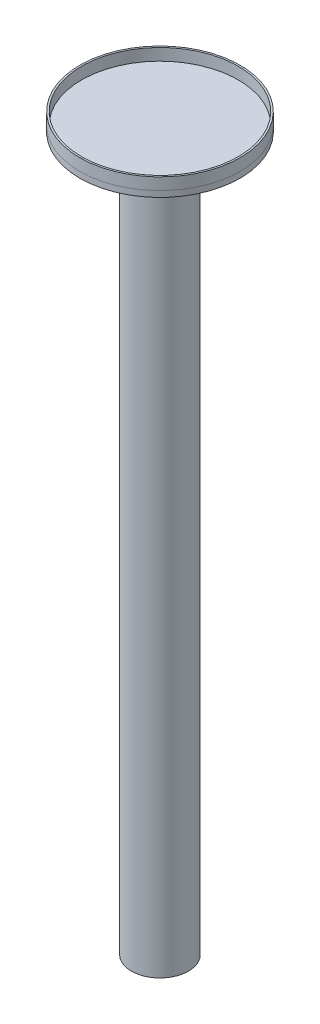
ISO-10303-21;
HEADER;
FILE_DESCRIPTION(('STEP AP214'),'2;1');
FILE_NAME('part.step','',(''),(''),'','','');
FILE_SCHEMA(('AUTOMOTIVE_DESIGN { 1 0 10303 214 1 1 1 1 }'));
ENDSEC;
DATA;
#1=APPLICATION_CONTEXT('core data for automotive mechanical design processes');
#2=APPLICATION_PROTOCOL_DEFINITION('international standard','automotive_design',2000,#1);
#3=PRODUCT_CONTEXT('',#1,'mechanical');
#4=PRODUCT('Part','Part','',(#3));
#5=PRODUCT_RELATED_PRODUCT_CATEGORY('part','',(#4));
#6=PRODUCT_DEFINITION_FORMATION('','',#4);
#7=PRODUCT_DEFINITION_CONTEXT('part definition',#1,'design');
#8=PRODUCT_DEFINITION('design','',#6,#7);
#9=PRODUCT_DEFINITION_SHAPE('','',#8);
#10=(LENGTH_UNIT() NAMED_UNIT(*) SI_UNIT(.MILLI.,.METRE.));
#11=(NAMED_UNIT(*) PLANE_ANGLE_UNIT() SI_UNIT($,.RADIAN.));
#12=(NAMED_UNIT(*) SI_UNIT($,.STERADIAN.) SOLID_ANGLE_UNIT());
#13=UNCERTAINTY_MEASURE_WITH_UNIT(LENGTH_MEASURE(1.E-05),#10,'distance_accuracy_value','');
#14=(GEOMETRIC_REPRESENTATION_CONTEXT(3) GLOBAL_UNCERTAINTY_ASSIGNED_CONTEXT((#13)) GLOBAL_UNIT_ASSIGNED_CONTEXT((#10,
#11,#12)) REPRESENTATION_CONTEXT('',''));
#15=CARTESIAN_POINT('',(0.,0.,0.));
#16=DIRECTION('',(0.,0.,1.));
#17=DIRECTION('',(1.,0.,0.));
#18=AXIS2_PLACEMENT_3D('',#15,#16,#17);
#19=CARTESIAN_POINT('',(0.,615.,0.));
#20=DIRECTION('',(0.,1.,0.));
#21=DIRECTION('',(0.,0.,1.));
#22=AXIS2_PLACEMENT_3D('',#19,#20,#21);
#23=PLANE('',#22);
#24=CARTESIAN_POINT('',(0.,615.,0.));
#25=DIRECTION('',(0.,1.,0.));
#26=DIRECTION('',(0.,0.,1.));
#27=AXIS2_PLACEMENT_3D('',#24,#25,#26);
#28=CIRCLE('',#27,67.5);
#29=CARTESIAN_POINT('',(0.,615.,67.5));
#30=VERTEX_POINT('',#29);
#31=EDGE_CURVE('E11',#30,#30,#28,.T.);
#32=ORIENTED_EDGE('',*,*,#31,.T.);
#33=EDGE_LOOP('',(#32));
#34=FACE_BOUND('',#33,.T.);
#35=CARTESIAN_POINT('',(0.,615.,0.));
#36=DIRECTION('',(0.,1.,0.));
#37=DIRECTION('',(0.,0.,1.));
#38=AXIS2_PLACEMENT_3D('',#35,#36,#37);
#39=CIRCLE('',#38,66.);
#40=CARTESIAN_POINT('',(0.,615.,66.));
#41=VERTEX_POINT('',#40);
#42=EDGE_CURVE('E50',#41,#41,#39,.T.);
#43=ORIENTED_EDGE('',*,*,#42,.F.);
#44=EDGE_LOOP('',(#43));
#45=FACE_BOUND('',#44,.T.);
#46=ADVANCED_FACE('F39',(#34,#45),#23,.T.);
#47=CARTESIAN_POINT('',(0.,605.,0.));
#48=DIRECTION('',(0.,1.,0.));
#49=DIRECTION('',(0.,0.,1.));
#50=AXIS2_PLACEMENT_3D('',#47,#48,#49);
#51=PLANE('',#50);
#52=CARTESIAN_POINT('',(0.,605.,0.));
#53=DIRECTION('',(0.,1.,0.));
#54=DIRECTION('',(0.,0.,1.));
#55=AXIS2_PLACEMENT_3D('',#52,#53,#54);
#56=CIRCLE('',#55,67.5);
#57=CARTESIAN_POINT('',(0.,605.,67.5));
#58=VERTEX_POINT('',#57);
#59=EDGE_CURVE('E43',#58,#58,#56,.T.);
#60=ORIENTED_EDGE('',*,*,#59,.F.);
#61=EDGE_LOOP('',(#60));
#62=FACE_BOUND('',#61,.T.);
#63=CARTESIAN_POINT('',(0.,605.,0.));
#64=DIRECTION('',(0.,1.,0.));
#65=DIRECTION('',(0.,0.,1.));
#66=AXIS2_PLACEMENT_3D('',#63,#64,#65);
#67=CIRCLE('',#66,66.);
#68=CARTESIAN_POINT('',(0.,605.,66.));
#69=VERTEX_POINT('',#68);
#70=EDGE_CURVE('E52',#69,#69,#67,.T.);
#71=ORIENTED_EDGE('',*,*,#70,.T.);
#72=EDGE_LOOP('',(#71));
#73=FACE_BOUND('',#72,.T.);
#74=ADVANCED_FACE('F62',(#62,#73),#51,.F.);
#75=CARTESIAN_POINT('',(0.,615.,0.));
#76=DIRECTION('',(0.,-1.,0.));
#77=DIRECTION('',(0.,0.,-1.));
#78=AXIS2_PLACEMENT_3D('',#75,#76,#77);
#79=CYLINDRICAL_SURFACE('',#78,67.5);
#80=ORIENTED_EDGE('',*,*,#31,.F.);
#81=EDGE_LOOP('',(#80));
#82=FACE_BOUND('',#81,.T.);
#83=ORIENTED_EDGE('',*,*,#59,.T.);
#84=EDGE_LOOP('',(#83));
#85=FACE_BOUND('',#84,.T.);
#86=ADVANCED_FACE('F41',(#82,#85),#79,.T.);
#87=CARTESIAN_POINT('',(0.,615.,0.));
#88=DIRECTION('',(0.,-1.,0.));
#89=DIRECTION('',(0.,0.,-1.));
#90=AXIS2_PLACEMENT_3D('',#87,#88,#89);
#91=CYLINDRICAL_SURFACE('',#90,66.);
#92=ORIENTED_EDGE('',*,*,#42,.T.);
#93=EDGE_LOOP('',(#92));
#94=FACE_BOUND('',#93,.T.);
#95=ORIENTED_EDGE('',*,*,#70,.F.);
#96=EDGE_LOOP('',(#95));
#97=FACE_BOUND('',#96,.T.);
#98=ADVANCED_FACE('F58',(#94,#97),#91,.F.);
#99=CLOSED_SHELL('',(#46,#74,#86,#98));
#100=MANIFOLD_SOLID_BREP('B2',#99);
#101=CARTESIAN_POINT('',(0.,600.,0.));
#102=DIRECTION('',(0.,-1.,0.));
#103=DIRECTION('',(0.,0.,-1.));
#104=AXIS2_PLACEMENT_3D('',#101,#102,#103);
#105=CYLINDRICAL_SURFACE('',#104,24.);
#106=CARTESIAN_POINT('',(0.,600.,0.));
#107=DIRECTION('',(0.,1.,0.));
#108=DIRECTION('',(0.,0.,1.));
#109=AXIS2_PLACEMENT_3D('',#106,#107,#108);
#110=CIRCLE('',#109,24.);
#111=CARTESIAN_POINT('',(0.,600.,24.));
#112=VERTEX_POINT('',#111);
#113=EDGE_CURVE('E38',#112,#112,#110,.T.);
#114=ORIENTED_EDGE('',*,*,#113,.F.);
#115=EDGE_LOOP('',(#114));
#116=FACE_BOUND('',#115,.T.);
#117=CARTESIAN_POINT('',(0.,0.,0.));
#118=DIRECTION('',(0.,1.,0.));
#119=DIRECTION('',(0.,0.,1.));
#120=AXIS2_PLACEMENT_3D('',#117,#118,#119);
#121=CIRCLE('',#120,24.);
#122=CARTESIAN_POINT('',(0.,0.,24.));
#123=VERTEX_POINT('',#122);
#124=EDGE_CURVE('E104',#123,#123,#121,.T.);
#125=ORIENTED_EDGE('',*,*,#124,.T.);
#126=EDGE_LOOP('',(#125));
#127=FACE_BOUND('',#126,.T.);
#128=ADVANCED_FACE('F101',(#116,#127),#105,.T.);
#129=CARTESIAN_POINT('',(0.,0.,0.));
#130=DIRECTION('',(0.,1.,0.));
#131=DIRECTION('',(0.,0.,1.));
#132=AXIS2_PLACEMENT_3D('',#129,#130,#131);
#133=PLANE('',#132);
#134=ORIENTED_EDGE('',*,*,#124,.F.);
#135=EDGE_LOOP('',(#134));
#136=FACE_BOUND('',#135,.T.);
#137=ADVANCED_FACE('F124',(#136),#133,.F.);
#138=CARTESIAN_POINT('',(0.,605.,0.));
#139=DIRECTION('',(0.,-1.,0.));
#140=DIRECTION('',(0.,0.,-1.));
#141=AXIS2_PLACEMENT_3D('',#138,#139,#140);
#142=CYLINDRICAL_SURFACE('',#141,67.5);
#143=CARTESIAN_POINT('',(0.,605.,0.));
#144=DIRECTION('',(0.,1.,0.));
#145=DIRECTION('',(0.,0.,1.));
#146=AXIS2_PLACEMENT_3D('',#143,#144,#145);
#147=CIRCLE('',#146,67.5);
#148=CARTESIAN_POINT('',(0.,605.,67.5));
#149=VERTEX_POINT('',#148);
#150=EDGE_CURVE('E111',#149,#149,#147,.T.);
#151=ORIENTED_EDGE('',*,*,#150,.F.);
#152=EDGE_LOOP('',(#151));
#153=FACE_BOUND('',#152,.T.);
#154=CARTESIAN_POINT('',(0.,600.,0.));
#155=DIRECTION('',(0.,1.,0.));
#156=DIRECTION('',(0.,0.,1.));
#157=AXIS2_PLACEMENT_3D('',#154,#155,#156);
#158=CIRCLE('',#157,67.5);
#159=CARTESIAN_POINT('',(0.,600.,67.5));
#160=VERTEX_POINT('',#159);
#161=EDGE_CURVE('E113',#160,#160,#158,.T.);
#162=ORIENTED_EDGE('',*,*,#161,.T.);
#163=EDGE_LOOP('',(#162));
#164=FACE_BOUND('',#163,.T.);
#165=ADVANCED_FACE('F121',(#153,#164),#142,.T.);
#166=CARTESIAN_POINT('',(0.,605.,0.));
#167=DIRECTION('',(0.,1.,0.));
#168=DIRECTION('',(0.,0.,1.));
#169=AXIS2_PLACEMENT_3D('',#166,#167,#168);
#170=PLANE('',#169);
#171=ORIENTED_EDGE('',*,*,#150,.T.);
#172=EDGE_LOOP('',(#171));
#173=FACE_BOUND('',#172,.T.);
#174=ADVANCED_FACE('F119',(#173),#170,.T.);
#175=CARTESIAN_POINT('',(0.,600.,0.));
#176=DIRECTION('',(0.,1.,0.));
#177=DIRECTION('',(0.,0.,1.));
#178=AXIS2_PLACEMENT_3D('',#175,#176,#177);
#179=PLANE('',#178);
#180=ORIENTED_EDGE('',*,*,#113,.T.);
#181=EDGE_LOOP('',(#180));
#182=FACE_BOUND('',#181,.T.);
#183=ORIENTED_EDGE('',*,*,#161,.F.);
#184=EDGE_LOOP('',(#183));
#185=FACE_BOUND('',#184,.T.);
#186=ADVANCED_FACE('F128',(#182,#185),#179,.F.);
#187=CLOSED_SHELL('',(#128,#137,#165,#174,#186));
#188=MANIFOLD_SOLID_BREP('B6',#187);
#189=ADVANCED_BREP_SHAPE_REPRESENTATION('',(#18,#100,#188),#14);
#190=SHAPE_DEFINITION_REPRESENTATION(#9,#189);
ENDSEC;
END-ISO-10303-21;
